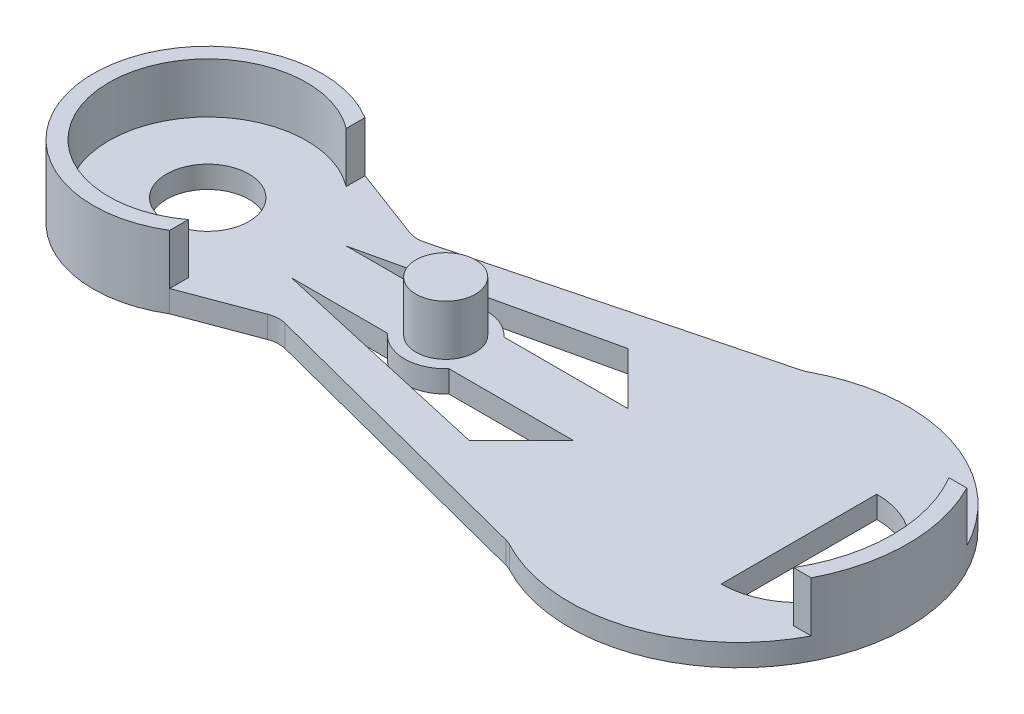
ISO-10303-21;
HEADER;
FILE_DESCRIPTION(('STEP AP214'),'2;1');
FILE_NAME('part.step','',(''),(''),'','','');
FILE_SCHEMA(('AUTOMOTIVE_DESIGN { 1 0 10303 214 1 1 1 1 }'));
ENDSEC;
DATA;
#1=APPLICATION_CONTEXT('core data for automotive mechanical design processes');
#2=APPLICATION_PROTOCOL_DEFINITION('international standard','automotive_design',2000,#1);
#3=PRODUCT_CONTEXT('',#1,'mechanical');
#4=PRODUCT('Part','Part','',(#3));
#5=PRODUCT_RELATED_PRODUCT_CATEGORY('part','',(#4));
#6=PRODUCT_DEFINITION_FORMATION('','',#4);
#7=PRODUCT_DEFINITION_CONTEXT('part definition',#1,'design');
#8=PRODUCT_DEFINITION('design','',#6,#7);
#9=PRODUCT_DEFINITION_SHAPE('','',#8);
#10=(LENGTH_UNIT() NAMED_UNIT(*) SI_UNIT(.MILLI.,.METRE.));
#11=(NAMED_UNIT(*) PLANE_ANGLE_UNIT() SI_UNIT($,.RADIAN.));
#12=(NAMED_UNIT(*) SI_UNIT($,.STERADIAN.) SOLID_ANGLE_UNIT());
#13=UNCERTAINTY_MEASURE_WITH_UNIT(LENGTH_MEASURE(1.E-05),#10,'distance_accuracy_value','');
#14=(GEOMETRIC_REPRESENTATION_CONTEXT(3) GLOBAL_UNCERTAINTY_ASSIGNED_CONTEXT((#13)) GLOBAL_UNIT_ASSIGNED_CONTEXT((#10,
#11,#12)) REPRESENTATION_CONTEXT('',''));
#15=CARTESIAN_POINT('',(0.,0.,0.));
#16=DIRECTION('',(0.,0.,1.));
#17=DIRECTION('',(1.,0.,0.));
#18=AXIS2_PLACEMENT_3D('',#15,#16,#17);
#19=CARTESIAN_POINT('',(-54.8824172838894,2.4,0.));
#20=DIRECTION('',(0.,-1.,0.));
#21=DIRECTION('',(0.,0.,-1.));
#22=AXIS2_PLACEMENT_3D('',#19,#20,#21);
#23=CYLINDRICAL_SURFACE('',#22,12.5);
#24=CARTESIAN_POINT('',(-54.8824172838894,0.,0.));
#25=DIRECTION('',(0.,1.,0.));
#26=DIRECTION('',(0.,0.,1.));
#27=AXIS2_PLACEMENT_3D('',#24,#25,#26);
#28=CIRCLE('',#27,12.5);
#29=CARTESIAN_POINT('',(-48.3711591182894,0.,-10.6702163567993));
#30=VERTEX_POINT('',#29);
#31=CARTESIAN_POINT('',(-48.3711591182894,0.,10.6702163567993));
#32=VERTEX_POINT('',#31);
#33=EDGE_CURVE('E441',#30,#32,#28,.T.);
#34=ORIENTED_EDGE('',*,*,#33,.T.);
#35=DIRECTION('',(0.,-1.,0.));
#36=VECTOR('',#35,1.);
#37=CARTESIAN_POINT('',(-48.3711591182894,2.4,10.6702163567993));
#38=LINE('',#37,#36);
#39=CARTESIAN_POINT('',(-48.3711591182894,2.4,10.6702163567993));
#40=VERTEX_POINT('',#39);
#41=EDGE_CURVE('E467',#40,#32,#38,.T.);
#42=ORIENTED_EDGE('',*,*,#41,.F.);
#43=DIRECTION('',(0.,-1.,0.));
#44=VECTOR('',#43,1.);
#45=CARTESIAN_POINT('',(-48.3711591182894,7.9,10.6702163567993));
#46=LINE('',#45,#44);
#47=CARTESIAN_POINT('',(-48.3711591182894,7.9,10.6702163567993));
#48=VERTEX_POINT('',#47);
#49=EDGE_CURVE('E304',#48,#40,#46,.T.);
#50=ORIENTED_EDGE('',*,*,#49,.F.);
#51=CARTESIAN_POINT('',(-54.8824172838894,7.9,0.));
#52=DIRECTION('',(0.,1.,0.));
#53=DIRECTION('',(0.,0.,1.));
#54=AXIS2_PLACEMENT_3D('',#51,#52,#53);
#55=CIRCLE('',#54,12.5);
#56=CARTESIAN_POINT('',(-48.3711591182894,7.9,-10.6702163567993));
#57=VERTEX_POINT('',#56);
#58=EDGE_CURVE('E291',#57,#48,#55,.T.);
#59=ORIENTED_EDGE('',*,*,#58,.F.);
#60=DIRECTION('',(0.,-1.,0.));
#61=VECTOR('',#60,1.);
#62=CARTESIAN_POINT('',(-48.3711591182894,7.9,-10.6702163567993));
#63=LINE('',#62,#61);
#64=CARTESIAN_POINT('',(-48.3711591182894,2.4,-10.6702163567993));
#65=VERTEX_POINT('',#64);
#66=EDGE_CURVE('E308',#57,#65,#63,.T.);
#67=ORIENTED_EDGE('',*,*,#66,.T.);
#68=DIRECTION('',(0.,-1.,0.));
#69=VECTOR('',#68,1.);
#70=CARTESIAN_POINT('',(-48.3711591182894,2.4,-10.6702163567993));
#71=LINE('',#70,#69);
#72=EDGE_CURVE('E464',#65,#30,#71,.T.);
#73=ORIENTED_EDGE('',*,*,#72,.T.);
#74=EDGE_LOOP('',(#34,#42,#50,#59,#67,#73));
#75=FACE_BOUND('',#74,.T.);
#76=ADVANCED_FACE('F45',(#75),#23,.T.);
#77=CARTESIAN_POINT('',(-2.45707890344702,2.4,-6.55092972925865));
#78=DIRECTION('',(-0.351183619747819,0.,-0.936306608553426));
#79=DIRECTION('',(-0.936306608553427,0.,0.351183619747819));
#80=AXIS2_PLACEMENT_3D('',#77,#78,#79);
#81=PLANE('',#80);
#82=DIRECTION('',(0.936306608553427,0.,-0.351183619747819));
#83=VECTOR('',#82,1.);
#84=CARTESIAN_POINT('',(-2.45707890344702,0.,-6.55092972925865));
#85=LINE('',#84,#83);
#86=CARTESIAN_POINT('',(-40.5871949467527,0.,7.75065914255413));
#87=VERTEX_POINT('',#86);
#88=EDGE_CURVE('E445',#32,#87,#85,.T.);
#89=ORIENTED_EDGE('',*,*,#88,.T.);
#90=DIRECTION('',(0.,-1.,0.));
#91=VECTOR('',#90,1.);
#92=CARTESIAN_POINT('',(-40.5871949467527,2.4,7.75065914255414));
#93=LINE('',#92,#91);
#94=CARTESIAN_POINT('',(-40.5871949467527,2.4,7.75065914255413));
#95=VERTEX_POINT('',#94);
#96=EDGE_CURVE('E537',#87,#95,#93,.F.);
#97=ORIENTED_EDGE('',*,*,#96,.T.);
#98=DIRECTION('',(0.936306608553427,0.,-0.351183619747819));
#99=VECTOR('',#98,1.);
#100=CARTESIAN_POINT('',(-2.45707890344702,2.4,-6.55092972925865));
#101=LINE('',#100,#99);
#102=EDGE_CURVE('E373',#40,#95,#101,.T.);
#103=ORIENTED_EDGE('',*,*,#102,.F.);
#104=ORIENTED_EDGE('',*,*,#41,.T.);
#105=EDGE_LOOP('',(#89,#97,#103,#104));
#106=FACE_BOUND('',#105,.T.);
#107=ADVANCED_FACE('F566',(#106),#81,.F.);
#108=CARTESIAN_POINT('',(-4.29192281992173,2.4,16.5822216350549));
#109=DIRECTION('',(0.250569813551526,0.,-0.968098532452536));
#110=DIRECTION('',(-0.968098532452536,0.,-0.250569813551526));
#111=AXIS2_PLACEMENT_3D('',#108,#109,#110);
#112=PLANE('',#111);
#113=DIRECTION('',(0.968098532452536,0.,0.250569813551526));
#114=VECTOR('',#113,1.);
#115=CARTESIAN_POINT('',(-4.29192281992173,0.,16.5822216350549));
#116=LINE('',#115,#114);
#117=CARTESIAN_POINT('',(-38.7819346468547,0.,7.6552833708568));
#118=VERTEX_POINT('',#117);
#119=CARTESIAN_POINT('',(-6.21340742603769,0.,16.0848899860987));
#120=VERTEX_POINT('',#119);
#121=EDGE_CURVE('E449',#118,#120,#116,.T.);
#122=ORIENTED_EDGE('',*,*,#121,.T.);
#123=DIRECTION('',(0.,1.,0.));
#124=VECTOR('',#123,1.);
#125=CARTESIAN_POINT('',(-6.21340742603769,2.4,16.0848899860987));
#126=LINE('',#125,#124);
#127=CARTESIAN_POINT('',(-6.21340742603769,2.4,16.0848899860987));
#128=VERTEX_POINT('',#127);
#129=EDGE_CURVE('E530',#120,#128,#126,.T.);
#130=ORIENTED_EDGE('',*,*,#129,.T.);
#131=DIRECTION('',(0.968098532452536,0.,0.250569813551526));
#132=VECTOR('',#131,1.);
#133=CARTESIAN_POINT('',(-4.29192281992173,2.4,16.5822216350549));
#134=LINE('',#133,#132);
#135=CARTESIAN_POINT('',(-38.7819346468547,2.4,7.6552833708568));
#136=VERTEX_POINT('',#135);
#137=EDGE_CURVE('E377',#136,#128,#134,.T.);
#138=ORIENTED_EDGE('',*,*,#137,.F.);
#139=DIRECTION('',(0.,-1.,0.));
#140=VECTOR('',#139,1.);
#141=CARTESIAN_POINT('',(-38.7819346468547,0.,7.6552833708568));
#142=LINE('',#141,#140);
#143=EDGE_CURVE('E526',#136,#118,#142,.T.);
#144=ORIENTED_EDGE('',*,*,#143,.T.);
#145=EDGE_LOOP('',(#122,#130,#138,#144));
#146=FACE_BOUND('',#145,.T.);
#147=ADVANCED_FACE('F575',(#146),#112,.F.);
#148=CARTESIAN_POINT('',(3.11758271611062,2.4,0.));
#149=DIRECTION('',(0.,-1.,0.));
#150=DIRECTION('',(0.,0.,-1.));
#151=AXIS2_PLACEMENT_3D('',#148,#149,#150);
#152=CYLINDRICAL_SURFACE('',#151,18.5);
#153=CARTESIAN_POINT('',(3.11758271611062,0.,0.));
#154=DIRECTION('',(0.,1.,0.));
#155=DIRECTION('',(0.,0.,1.));
#156=AXIS2_PLACEMENT_3D('',#153,#154,#155);
#157=CIRCLE('',#156,18.5);
#158=CARTESIAN_POINT('',(-5.55822855281279,0.,16.3395317811136));
#159=VERTEX_POINT('',#158);
#160=CARTESIAN_POINT('',(-5.55822855281279,0.,-16.3395317811136));
#161=VERTEX_POINT('',#160);
#162=EDGE_CURVE('E453',#159,#161,#157,.T.);
#163=ORIENTED_EDGE('',*,*,#162,.T.);
#164=DIRECTION('',(0.,-1.,0.));
#165=VECTOR('',#164,1.);
#166=CARTESIAN_POINT('',(-5.55822855281279,2.4,-16.3395317811136));
#167=LINE('',#166,#165);
#168=CARTESIAN_POINT('',(-5.55822855281279,2.4,-16.3395317811136));
#169=VERTEX_POINT('',#168);
#170=EDGE_CURVE('E522',#161,#169,#167,.F.);
#171=ORIENTED_EDGE('',*,*,#170,.T.);
#172=CARTESIAN_POINT('',(3.11758271611062,2.4,0.));
#173=DIRECTION('',(0.,1.,0.));
#174=DIRECTION('',(0.,0.,1.));
#175=AXIS2_PLACEMENT_3D('',#172,#173,#174);
#176=CIRCLE('',#175,18.5);
#177=CARTESIAN_POINT('',(19.5492594412656,2.4,-8.5));
#178=VERTEX_POINT('',#177);
#179=EDGE_CURVE('E381',#178,#169,#176,.T.);
#180=ORIENTED_EDGE('',*,*,#179,.F.);
#181=DIRECTION('',(0.,-1.,0.));
#182=VECTOR('',#181,1.);
#183=CARTESIAN_POINT('',(19.5492594412656,7.9,-8.5));
#184=LINE('',#183,#182);
#185=CARTESIAN_POINT('',(19.5492594412656,7.9,-8.5));
#186=VERTEX_POINT('',#185);
#187=EDGE_CURVE('E269',#186,#178,#184,.T.);
#188=ORIENTED_EDGE('',*,*,#187,.F.);
#189=CARTESIAN_POINT('',(3.11758271611062,7.9,0.));
#190=DIRECTION('',(0.,1.,0.));
#191=DIRECTION('',(0.,0.,1.));
#192=AXIS2_PLACEMENT_3D('',#189,#190,#191);
#193=CIRCLE('',#192,18.5);
#194=CARTESIAN_POINT('',(19.5492594412656,7.9,8.5));
#195=VERTEX_POINT('',#194);
#196=EDGE_CURVE('E258',#195,#186,#193,.T.);
#197=ORIENTED_EDGE('',*,*,#196,.F.);
#198=DIRECTION('',(0.,-1.,0.));
#199=VECTOR('',#198,1.);
#200=CARTESIAN_POINT('',(19.5492594412656,7.9,8.5));
#201=LINE('',#200,#199);
#202=CARTESIAN_POINT('',(19.5492594412656,2.4,8.5));
#203=VERTEX_POINT('',#202);
#204=EDGE_CURVE('E276',#195,#203,#201,.T.);
#205=ORIENTED_EDGE('',*,*,#204,.T.);
#206=CARTESIAN_POINT('',(-5.55822855281279,2.4,16.3395317811136));
#207=VERTEX_POINT('',#206);
#208=EDGE_CURVE('E382',#207,#203,#176,.T.);
#209=ORIENTED_EDGE('',*,*,#208,.F.);
#210=DIRECTION('',(0.,-1.,0.));
#211=VECTOR('',#210,1.);
#212=CARTESIAN_POINT('',(-5.55822855281279,2.4,16.3395317811136));
#213=LINE('',#212,#211);
#214=EDGE_CURVE('E518',#207,#159,#213,.T.);
#215=ORIENTED_EDGE('',*,*,#214,.T.);
#216=EDGE_LOOP('',(#163,#171,#180,#188,#197,#205,#209,#215));
#217=FACE_BOUND('',#216,.T.);
#218=ADVANCED_FACE('F582',(#217),#152,.T.);
#219=CARTESIAN_POINT('',(-4.29192281992173,2.4,-16.5822216350549));
#220=DIRECTION('',(-0.250569813551526,0.,-0.968098532452536));
#221=DIRECTION('',(-0.968098532452536,0.,0.250569813551526));
#222=AXIS2_PLACEMENT_3D('',#219,#220,#221);
#223=PLANE('',#222);
#224=DIRECTION('',(0.968098532452536,0.,-0.250569813551526));
#225=VECTOR('',#224,1.);
#226=CARTESIAN_POINT('',(-4.29192281992173,2.4,-16.5822216350549));
#227=LINE('',#226,#225);
#228=CARTESIAN_POINT('',(-38.7819346468547,2.4,-7.6552833708568));
#229=VERTEX_POINT('',#228);
#230=CARTESIAN_POINT('',(-6.21340742603769,2.4,-16.0848899860987));
#231=VERTEX_POINT('',#230);
#232=EDGE_CURVE('E385',#229,#231,#227,.T.);
#233=ORIENTED_EDGE('',*,*,#232,.T.);
#234=DIRECTION('',(0.,-1.,0.));
#235=VECTOR('',#234,1.);
#236=CARTESIAN_POINT('',(-6.21340742603769,2.4,-16.0848899860987));
#237=LINE('',#236,#235);
#238=CARTESIAN_POINT('',(-6.21340742603769,0.,-16.0848899860987));
#239=VERTEX_POINT('',#238);
#240=EDGE_CURVE('E514',#231,#239,#237,.T.);
#241=ORIENTED_EDGE('',*,*,#240,.T.);
#242=DIRECTION('',(0.968098532452536,0.,-0.250569813551526));
#243=VECTOR('',#242,1.);
#244=CARTESIAN_POINT('',(-4.29192281992173,0.,-16.5822216350549));
#245=LINE('',#244,#243);
#246=CARTESIAN_POINT('',(-38.7819346468547,0.,-7.6552833708568));
#247=VERTEX_POINT('',#246);
#248=EDGE_CURVE('E457',#247,#239,#245,.T.);
#249=ORIENTED_EDGE('',*,*,#248,.F.);
#250=DIRECTION('',(0.,-1.,0.));
#251=VECTOR('',#250,1.);
#252=CARTESIAN_POINT('',(-38.7819346468547,2.4,-7.6552833708568));
#253=LINE('',#252,#251);
#254=EDGE_CURVE('E472',#247,#229,#253,.F.);
#255=ORIENTED_EDGE('',*,*,#254,.T.);
#256=EDGE_LOOP('',(#233,#241,#249,#255));
#257=FACE_BOUND('',#256,.T.);
#258=ADVANCED_FACE('F618',(#257),#223,.T.);
#259=CARTESIAN_POINT('',(9.717339795003,2.4,0.));
#260=DIRECTION('',(1.,0.,0.));
#261=DIRECTION('',(0.,0.,-1.));
#262=AXIS2_PLACEMENT_3D('',#259,#260,#261);
#263=PLANE('',#262);
#264=DIRECTION('',(0.,0.,1.));
#265=VECTOR('',#264,1.);
#266=CARTESIAN_POINT('',(9.717339795003,0.,0.));
#267=LINE('',#266,#265);
#268=CARTESIAN_POINT('',(9.717339795003,0.,-8.5));
#269=VERTEX_POINT('',#268);
#270=CARTESIAN_POINT('',(9.717339795003,0.,8.5));
#271=VERTEX_POINT('',#270);
#272=EDGE_CURVE('E429',#269,#271,#267,.T.);
#273=ORIENTED_EDGE('',*,*,#272,.F.);
#274=DIRECTION('',(0.,-1.,0.));
#275=VECTOR('',#274,1.);
#276=CARTESIAN_POINT('',(9.717339795003,2.4,-8.5));
#277=LINE('',#276,#275);
#278=CARTESIAN_POINT('',(9.717339795003,2.4,-8.5));
#279=VERTEX_POINT('',#278);
#280=EDGE_CURVE('E468',#279,#269,#277,.T.);
#281=ORIENTED_EDGE('',*,*,#280,.F.);
#282=DIRECTION('',(0.,0.,1.));
#283=VECTOR('',#282,1.);
#284=CARTESIAN_POINT('',(9.717339795003,2.4,0.));
#285=LINE('',#284,#283);
#286=CARTESIAN_POINT('',(9.717339795003,2.4,8.5));
#287=VERTEX_POINT('',#286);
#288=EDGE_CURVE('E361',#279,#287,#285,.T.);
#289=ORIENTED_EDGE('',*,*,#288,.T.);
#290=DIRECTION('',(0.,-1.,0.));
#291=VECTOR('',#290,1.);
#292=CARTESIAN_POINT('',(9.717339795003,2.4,8.5));
#293=LINE('',#292,#291);
#294=EDGE_CURVE('E473',#287,#271,#293,.T.);
#295=ORIENTED_EDGE('',*,*,#294,.T.);
#296=EDGE_LOOP('',(#273,#281,#289,#295));
#297=FACE_BOUND('',#296,.T.);
#298=ADVANCED_FACE('F614',(#297),#263,.T.);
#299=CARTESIAN_POINT('',(-4.47527295076371,2.4,4.47527295076364));
#300=DIRECTION('',(-0.707106781186554,0.,0.707106781186541));
#301=DIRECTION('',(0.707106781186541,0.,0.707106781186554));
#302=AXIS2_PLACEMENT_3D('',#299,#300,#301);
#303=PLANE('',#302);
#304=DIRECTION('',(-0.707106781186541,0.,-0.707106781186554));
#305=VECTOR('',#304,1.);
#306=CARTESIAN_POINT('',(-4.47527295076371,0.,4.47527295076364));
#307=LINE('',#306,#305);
#308=CARTESIAN_POINT('',(-11.9505459015272,0.,-3.00000000000001));
#309=VERTEX_POINT('',#308);
#310=CARTESIAN_POINT('',(-17.6349450814917,0.,-8.68439917996457));
#311=VERTEX_POINT('',#310);
#312=EDGE_CURVE('E409',#309,#311,#307,.T.);
#313=ORIENTED_EDGE('',*,*,#312,.F.);
#314=DIRECTION('',(0.,-1.,0.));
#315=VECTOR('',#314,1.);
#316=CARTESIAN_POINT('',(-11.9505459015272,2.4,-3.00000000000001));
#317=LINE('',#316,#315);
#318=CARTESIAN_POINT('',(-11.9505459015272,2.4,-3.00000000000001));
#319=VERTEX_POINT('',#318);
#320=EDGE_CURVE('E476',#319,#309,#317,.T.);
#321=ORIENTED_EDGE('',*,*,#320,.F.);
#322=DIRECTION('',(-0.707106781186541,0.,-0.707106781186554));
#323=VECTOR('',#322,1.);
#324=CARTESIAN_POINT('',(-4.47527295076371,2.4,4.47527295076364));
#325=LINE('',#324,#323);
#326=CARTESIAN_POINT('',(-17.6349450814917,2.4,-8.68439917996457));
#327=VERTEX_POINT('',#326);
#328=EDGE_CURVE('E342',#319,#327,#325,.T.);
#329=ORIENTED_EDGE('',*,*,#328,.T.);
#330=DIRECTION('',(0.,-1.,0.));
#331=VECTOR('',#330,1.);
#332=CARTESIAN_POINT('',(-17.6349450814917,2.4,-8.68439917996457));
#333=LINE('',#332,#331);
#334=EDGE_CURVE('E479',#327,#311,#333,.T.);
#335=ORIENTED_EDGE('',*,*,#334,.T.);
#336=EDGE_LOOP('',(#313,#321,#329,#335));
#337=FACE_BOUND('',#336,.T.);
#338=ADVANCED_FACE('F617',(#337),#303,.T.);
#339=CARTESIAN_POINT('',(0.,2.4,-3.));
#340=DIRECTION('',(0.,0.,-1.));
#341=DIRECTION('',(-1.,0.,0.));
#342=AXIS2_PLACEMENT_3D('',#339,#340,#341);
#343=PLANE('',#342);
#344=DIRECTION('',(1.,0.,0.));
#345=VECTOR('',#344,1.);
#346=CARTESIAN_POINT('',(0.,0.,-3.));
#347=LINE('',#346,#345);
#348=CARTESIAN_POINT('',(-25.5283153176397,0.,-3.00000000000001));
#349=VERTEX_POINT('',#348);
#350=EDGE_CURVE('E413',#349,#309,#347,.T.);
#351=ORIENTED_EDGE('',*,*,#350,.F.);
#352=DIRECTION('',(0.,-1.,0.));
#353=VECTOR('',#352,1.);
#354=CARTESIAN_POINT('',(-25.5283153176397,2.4,-3.00000000000001));
#355=LINE('',#354,#353);
#356=CARTESIAN_POINT('',(-25.5283153176397,2.4,-3.00000000000001));
#357=VERTEX_POINT('',#356);
#358=EDGE_CURVE('E489',#357,#349,#355,.T.);
#359=ORIENTED_EDGE('',*,*,#358,.F.);
#360=DIRECTION('',(1.,0.,0.));
#361=VECTOR('',#360,1.);
#362=CARTESIAN_POINT('',(0.,2.4,-3.));
#363=LINE('',#362,#361);
#364=EDGE_CURVE('E346',#357,#319,#363,.T.);
#365=ORIENTED_EDGE('',*,*,#364,.T.);
#366=ORIENTED_EDGE('',*,*,#320,.T.);
#367=EDGE_LOOP('',(#351,#359,#365,#366));
#368=FACE_BOUND('',#367,.T.);
#369=ADVANCED_FACE('F632',(#368),#343,.T.);
#370=CARTESIAN_POINT('',(-28.8824172838894,2.4,0.));
#371=DIRECTION('',(0.,-1.,0.));
#372=DIRECTION('',(0.,0.,-1.));
#373=AXIS2_PLACEMENT_3D('',#370,#371,#372);
#374=CYLINDRICAL_SURFACE('',#373,4.5);
#375=CARTESIAN_POINT('',(-28.8824172838894,0.,0.));
#376=DIRECTION('',(0.,1.,0.));
#377=DIRECTION('',(0.,0.,1.));
#378=AXIS2_PLACEMENT_3D('',#375,#376,#377);
#379=CIRCLE('',#378,4.5);
#380=CARTESIAN_POINT('',(-32.2365192501391,0.,-3.00000000000001));
#381=VERTEX_POINT('',#380);
#382=EDGE_CURVE('E417',#349,#381,#379,.T.);
#383=ORIENTED_EDGE('',*,*,#382,.T.);
#384=DIRECTION('',(0.,-1.,0.));
#385=VECTOR('',#384,1.);
#386=CARTESIAN_POINT('',(-32.2365192501391,2.4,-3.00000000000001));
#387=LINE('',#386,#385);
#388=CARTESIAN_POINT('',(-32.2365192501391,2.4,-3.00000000000001));
#389=VERTEX_POINT('',#388);
#390=EDGE_CURVE('E486',#389,#381,#387,.T.);
#391=ORIENTED_EDGE('',*,*,#390,.F.);
#392=CARTESIAN_POINT('',(-28.8824172838894,2.4,0.));
#393=DIRECTION('',(0.,1.,0.));
#394=DIRECTION('',(0.,0.,1.));
#395=AXIS2_PLACEMENT_3D('',#392,#393,#394);
#396=CIRCLE('',#395,4.5);
#397=EDGE_CURVE('E350',#357,#389,#396,.T.);
#398=ORIENTED_EDGE('',*,*,#397,.F.);
#399=ORIENTED_EDGE('',*,*,#358,.T.);
#400=EDGE_LOOP('',(#383,#391,#398,#399));
#401=FACE_BOUND('',#400,.T.);
#402=ADVANCED_FACE('F628',(#401),#374,.T.);
#403=CARTESIAN_POINT('',(0.,2.4,-3.00000000000001));
#404=DIRECTION('',(0.,0.,-1.));
#405=DIRECTION('',(-1.,0.,0.));
#406=AXIS2_PLACEMENT_3D('',#403,#404,#405);
#407=PLANE('',#406);
#408=DIRECTION('',(1.,0.,0.));
#409=VECTOR('',#408,1.);
#410=CARTESIAN_POINT('',(0.,0.,-3.00000000000001));
#411=LINE('',#410,#409);
#412=CARTESIAN_POINT('',(-42.7477561843778,0.,-3.));
#413=VERTEX_POINT('',#412);
#414=EDGE_CURVE('E421',#413,#381,#411,.T.);
#415=ORIENTED_EDGE('',*,*,#414,.F.);
#416=DIRECTION('',(0.,-1.,0.));
#417=VECTOR('',#416,1.);
#418=CARTESIAN_POINT('',(-42.7477561843778,2.4,-3.));
#419=LINE('',#418,#417);
#420=CARTESIAN_POINT('',(-42.7477561843778,2.4,-3.));
#421=VERTEX_POINT('',#420);
#422=EDGE_CURVE('E482',#421,#413,#419,.T.);
#423=ORIENTED_EDGE('',*,*,#422,.F.);
#424=DIRECTION('',(1.,0.,0.));
#425=VECTOR('',#424,1.);
#426=CARTESIAN_POINT('',(0.,2.4,-3.00000000000001));
#427=LINE('',#426,#425);
#428=EDGE_CURVE('E353',#421,#389,#427,.T.);
#429=ORIENTED_EDGE('',*,*,#428,.T.);
#430=ORIENTED_EDGE('',*,*,#390,.T.);
#431=EDGE_LOOP('',(#415,#423,#429,#430));
#432=FACE_BOUND('',#431,.T.);
#433=ADVANCED_FACE('F624',(#432),#407,.T.);
#434=CARTESIAN_POINT('',(0.,2.4,3.));
#435=DIRECTION('',(0.,0.,-1.));
#436=DIRECTION('',(-1.,0.,0.));
#437=AXIS2_PLACEMENT_3D('',#434,#435,#436);
#438=PLANE('',#437);
#439=DIRECTION('',(1.,0.,0.));
#440=VECTOR('',#439,1.);
#441=CARTESIAN_POINT('',(0.,0.,3.));
#442=LINE('',#441,#440);
#443=CARTESIAN_POINT('',(-25.5283153176397,0.,3.00000000000001));
#444=VERTEX_POINT('',#443);
#445=CARTESIAN_POINT('',(-11.9505459015272,0.,3.00000000000001));
#446=VERTEX_POINT('',#445);
#447=EDGE_CURVE('E321',#444,#446,#442,.T.);
#448=ORIENTED_EDGE('',*,*,#447,.T.);
#449=DIRECTION('',(0.,-1.,0.));
#450=VECTOR('',#449,1.);
#451=CARTESIAN_POINT('',(-11.9505459015272,2.4,3.00000000000001));
#452=LINE('',#451,#450);
#453=CARTESIAN_POINT('',(-11.9505459015272,2.4,3.00000000000001));
#454=VERTEX_POINT('',#453);
#455=EDGE_CURVE('E483',#454,#446,#452,.T.);
#456=ORIENTED_EDGE('',*,*,#455,.F.);
#457=DIRECTION('',(1.,0.,0.));
#458=VECTOR('',#457,1.);
#459=CARTESIAN_POINT('',(0.,2.4,3.));
#460=LINE('',#459,#458);
#461=CARTESIAN_POINT('',(-25.5283153176397,2.4,3.00000000000001));
#462=VERTEX_POINT('',#461);
#463=EDGE_CURVE('E325',#462,#454,#460,.T.);
#464=ORIENTED_EDGE('',*,*,#463,.F.);
#465=DIRECTION('',(0.,-1.,0.));
#466=VECTOR('',#465,1.);
#467=CARTESIAN_POINT('',(-25.5283153176397,2.4,3.00000000000001));
#468=LINE('',#467,#466);
#469=EDGE_CURVE('E393',#462,#444,#468,.T.);
#470=ORIENTED_EDGE('',*,*,#469,.T.);
#471=EDGE_LOOP('',(#448,#456,#464,#470));
#472=FACE_BOUND('',#471,.T.);
#473=ADVANCED_FACE('F627',(#472),#438,.F.);
#474=CARTESIAN_POINT('',(-4.47527295076374,2.4,-4.47527295076364));
#475=DIRECTION('',(0.707106781186555,0.,0.70710678118654));
#476=DIRECTION('',(0.70710678118654,0.,-0.707106781186555));
#477=AXIS2_PLACEMENT_3D('',#474,#475,#476);
#478=PLANE('',#477);
#479=DIRECTION('',(-0.70710678118654,0.,0.707106781186555));
#480=VECTOR('',#479,1.);
#481=CARTESIAN_POINT('',(-4.47527295076374,0.,-4.47527295076364));
#482=LINE('',#481,#480);
#483=CARTESIAN_POINT('',(-17.6349450814917,0.,8.68439917996458));
#484=VERTEX_POINT('',#483);
#485=EDGE_CURVE('E397',#446,#484,#482,.T.);
#486=ORIENTED_EDGE('',*,*,#485,.T.);
#487=DIRECTION('',(0.,-1.,0.));
#488=VECTOR('',#487,1.);
#489=CARTESIAN_POINT('',(-17.6349450814917,2.4,8.68439917996458));
#490=LINE('',#489,#488);
#491=CARTESIAN_POINT('',(-17.6349450814917,2.4,8.68439917996458));
#492=VERTEX_POINT('',#491);
#493=EDGE_CURVE('E505',#492,#484,#490,.T.);
#494=ORIENTED_EDGE('',*,*,#493,.F.);
#495=DIRECTION('',(-0.70710678118654,0.,0.707106781186555));
#496=VECTOR('',#495,1.);
#497=CARTESIAN_POINT('',(-4.47527295076374,2.4,-4.47527295076364));
#498=LINE('',#497,#496);
#499=EDGE_CURVE('E329',#454,#492,#498,.T.);
#500=ORIENTED_EDGE('',*,*,#499,.F.);
#501=ORIENTED_EDGE('',*,*,#455,.T.);
#502=EDGE_LOOP('',(#486,#494,#500,#501));
#503=FACE_BOUND('',#502,.T.);
#504=ADVANCED_FACE('F650',(#503),#478,.F.);
#505=CARTESIAN_POINT('',(-2.7294566481405,2.4,12.0583243801496));
#506=DIRECTION('',(-0.22076948586132,0.,0.975326014270371));
#507=DIRECTION('',(0.975326014270371,0.,0.22076948586132));
#508=AXIS2_PLACEMENT_3D('',#505,#506,#507);
#509=PLANE('',#508);
#510=DIRECTION('',(-0.975326014270371,0.,-0.22076948586132));
#511=VECTOR('',#510,1.);
#512=CARTESIAN_POINT('',(-2.7294566481405,0.,12.0583243801496));
#513=LINE('',#512,#511);
#514=CARTESIAN_POINT('',(-42.7477561843778,0.,3.));
#515=VERTEX_POINT('',#514);
#516=EDGE_CURVE('E400',#484,#515,#513,.T.);
#517=ORIENTED_EDGE('',*,*,#516,.T.);
#518=DIRECTION('',(0.,-1.,0.));
#519=VECTOR('',#518,1.);
#520=CARTESIAN_POINT('',(-42.7477561843778,2.4,3.));
#521=LINE('',#520,#519);
#522=CARTESIAN_POINT('',(-42.7477561843778,2.4,3.));
#523=VERTEX_POINT('',#522);
#524=EDGE_CURVE('E501',#523,#515,#521,.T.);
#525=ORIENTED_EDGE('',*,*,#524,.F.);
#526=DIRECTION('',(-0.975326014270371,0.,-0.22076948586132));
#527=VECTOR('',#526,1.);
#528=CARTESIAN_POINT('',(-2.7294566481405,2.4,12.0583243801496));
#529=LINE('',#528,#527);
#530=EDGE_CURVE('E333',#492,#523,#529,.T.);
#531=ORIENTED_EDGE('',*,*,#530,.F.);
#532=ORIENTED_EDGE('',*,*,#493,.T.);
#533=EDGE_LOOP('',(#517,#525,#531,#532));
#534=FACE_BOUND('',#533,.T.);
#535=ADVANCED_FACE('F646',(#534),#509,.F.);
#536=CARTESIAN_POINT('',(0.,2.4,3.00000000000001));
#537=DIRECTION('',(0.,0.,-1.));
#538=DIRECTION('',(-1.,0.,0.));
#539=AXIS2_PLACEMENT_3D('',#536,#537,#538);
#540=PLANE('',#539);
#541=DIRECTION('',(1.,0.,0.));
#542=VECTOR('',#541,1.);
#543=CARTESIAN_POINT('',(0.,0.,3.00000000000001));
#544=LINE('',#543,#542);
#545=CARTESIAN_POINT('',(-32.2365192501391,0.,3.00000000000001));
#546=VERTEX_POINT('',#545);
#547=EDGE_CURVE('E403',#515,#546,#544,.T.);
#548=ORIENTED_EDGE('',*,*,#547,.T.);
#549=DIRECTION('',(0.,-1.,0.));
#550=VECTOR('',#549,1.);
#551=CARTESIAN_POINT('',(-32.2365192501391,2.4,3.00000000000001));
#552=LINE('',#551,#550);
#553=CARTESIAN_POINT('',(-32.2365192501391,2.4,3.00000000000001));
#554=VERTEX_POINT('',#553);
#555=EDGE_CURVE('E497',#554,#546,#552,.T.);
#556=ORIENTED_EDGE('',*,*,#555,.F.);
#557=DIRECTION('',(1.,0.,0.));
#558=VECTOR('',#557,1.);
#559=CARTESIAN_POINT('',(0.,2.4,3.00000000000001));
#560=LINE('',#559,#558);
#561=EDGE_CURVE('E336',#523,#554,#560,.T.);
#562=ORIENTED_EDGE('',*,*,#561,.F.);
#563=ORIENTED_EDGE('',*,*,#524,.T.);
#564=EDGE_LOOP('',(#548,#556,#562,#563));
#565=FACE_BOUND('',#564,.T.);
#566=ADVANCED_FACE('F608',(#565),#540,.F.);
#567=CARTESIAN_POINT('',(-54.8824172838894,2.4,0.));
#568=DIRECTION('',(0.,-1.,0.));
#569=DIRECTION('',(0.,0.,-1.));
#570=AXIS2_PLACEMENT_3D('',#567,#568,#569);
#571=CYLINDRICAL_SURFACE('',#570,4.5);
#572=CARTESIAN_POINT('',(-54.8824172838894,2.4,0.));
#573=DIRECTION('',(0.,1.,0.));
#574=DIRECTION('',(0.,0.,1.));
#575=AXIS2_PLACEMENT_3D('',#572,#573,#574);
#576=CIRCLE('',#575,4.5);
#577=CARTESIAN_POINT('',(-54.8824172838894,2.4,4.5));
#578=VERTEX_POINT('',#577);
#579=EDGE_CURVE('E369',#578,#578,#576,.T.);
#580=ORIENTED_EDGE('',*,*,#579,.T.);
#581=EDGE_LOOP('',(#580));
#582=FACE_BOUND('',#581,.T.);
#583=CARTESIAN_POINT('',(-54.8824172838894,0.,0.));
#584=DIRECTION('',(0.,1.,0.));
#585=DIRECTION('',(0.,0.,1.));
#586=AXIS2_PLACEMENT_3D('',#583,#584,#585);
#587=CIRCLE('',#586,4.5);
#588=CARTESIAN_POINT('',(-54.8824172838894,0.,4.5));
#589=VERTEX_POINT('',#588);
#590=EDGE_CURVE('E437',#589,#589,#587,.T.);
#591=ORIENTED_EDGE('',*,*,#590,.F.);
#592=EDGE_LOOP('',(#591));
#593=FACE_BOUND('',#592,.T.);
#594=ADVANCED_FACE('F604',(#582,#593),#571,.F.);
#595=CARTESIAN_POINT('',(9.717339795003,2.4,0.));
#596=DIRECTION('',(0.,-1.,0.));
#597=DIRECTION('',(0.,0.,-1.));
#598=AXIS2_PLACEMENT_3D('',#595,#596,#597);
#599=CYLINDRICAL_SURFACE('',#598,8.5);
#600=CARTESIAN_POINT('',(9.717339795003,0.,0.));
#601=DIRECTION('',(0.,1.,0.));
#602=DIRECTION('',(0.,0.,1.));
#603=AXIS2_PLACEMENT_3D('',#600,#601,#602);
#604=CIRCLE('',#603,8.5);
#605=EDGE_CURVE('E433',#271,#269,#604,.T.);
#606=ORIENTED_EDGE('',*,*,#605,.F.);
#607=ORIENTED_EDGE('',*,*,#294,.F.);
#608=CARTESIAN_POINT('',(9.717339795003,2.4,0.));
#609=DIRECTION('',(0.,1.,0.));
#610=DIRECTION('',(0.,0.,1.));
#611=AXIS2_PLACEMENT_3D('',#608,#609,#610);
#612=CIRCLE('',#611,8.5);
#613=EDGE_CURVE('E365',#287,#279,#612,.T.);
#614=ORIENTED_EDGE('',*,*,#613,.T.);
#615=ORIENTED_EDGE('',*,*,#280,.T.);
#616=EDGE_LOOP('',(#606,#607,#614,#615));
#617=FACE_BOUND('',#616,.T.);
#618=ADVANCED_FACE('F607',(#617),#599,.F.);
#619=CARTESIAN_POINT('',(-2.7294566481405,2.4,-12.0583243801496));
#620=DIRECTION('',(0.22076948586132,0.,0.975326014270371));
#621=DIRECTION('',(0.975326014270371,0.,-0.22076948586132));
#622=AXIS2_PLACEMENT_3D('',#619,#620,#621);
#623=PLANE('',#622);
#624=DIRECTION('',(-0.975326014270371,0.,0.22076948586132));
#625=VECTOR('',#624,1.);
#626=CARTESIAN_POINT('',(-2.7294566481405,0.,-12.0583243801496));
#627=LINE('',#626,#625);
#628=EDGE_CURVE('E425',#311,#413,#627,.T.);
#629=ORIENTED_EDGE('',*,*,#628,.F.);
#630=ORIENTED_EDGE('',*,*,#334,.F.);
#631=DIRECTION('',(-0.975326014270371,0.,0.22076948586132));
#632=VECTOR('',#631,1.);
#633=CARTESIAN_POINT('',(-2.7294566481405,2.4,-12.0583243801496));
#634=LINE('',#633,#632);
#635=EDGE_CURVE('E357',#327,#421,#634,.T.);
#636=ORIENTED_EDGE('',*,*,#635,.T.);
#637=ORIENTED_EDGE('',*,*,#422,.T.);
#638=EDGE_LOOP('',(#629,#630,#636,#637));
#639=FACE_BOUND('',#638,.T.);
#640=ADVANCED_FACE('F612',(#639),#623,.T.);
#641=CARTESIAN_POINT('',(-28.8824172838894,2.4,0.));
#642=DIRECTION('',(0.,-1.,0.));
#643=DIRECTION('',(0.,0.,-1.));
#644=AXIS2_PLACEMENT_3D('',#641,#642,#643);
#645=CYLINDRICAL_SURFACE('',#644,4.5);
#646=CARTESIAN_POINT('',(-28.8824172838894,0.,0.));
#647=DIRECTION('',(0.,1.,0.));
#648=DIRECTION('',(0.,0.,1.));
#649=AXIS2_PLACEMENT_3D('',#646,#647,#648);
#650=CIRCLE('',#649,4.5);
#651=EDGE_CURVE('E406',#546,#444,#650,.T.);
#652=ORIENTED_EDGE('',*,*,#651,.T.);
#653=ORIENTED_EDGE('',*,*,#469,.F.);
#654=CARTESIAN_POINT('',(-28.8824172838894,2.4,0.));
#655=DIRECTION('',(0.,1.,0.));
#656=DIRECTION('',(0.,0.,1.));
#657=AXIS2_PLACEMENT_3D('',#654,#655,#656);
#658=CIRCLE('',#657,4.5);
#659=EDGE_CURVE('E339',#554,#462,#658,.T.);
#660=ORIENTED_EDGE('',*,*,#659,.F.);
#661=ORIENTED_EDGE('',*,*,#555,.T.);
#662=EDGE_LOOP('',(#652,#653,#660,#661));
#663=FACE_BOUND('',#662,.T.);
#664=ADVANCED_FACE('F622',(#663),#645,.T.);
#665=CARTESIAN_POINT('',(-2.45707890344702,2.4,6.55092972925865));
#666=DIRECTION('',(0.351183619747819,0.,-0.936306608553426));
#667=DIRECTION('',(-0.936306608553427,0.,-0.351183619747819));
#668=AXIS2_PLACEMENT_3D('',#665,#666,#667);
#669=PLANE('',#668);
#670=DIRECTION('',(0.936306608553427,0.,0.351183619747819));
#671=VECTOR('',#670,1.);
#672=CARTESIAN_POINT('',(-2.45707890344702,2.4,6.55092972925865));
#673=LINE('',#672,#671);
#674=CARTESIAN_POINT('',(-40.5871949467527,2.4,-7.75065914255413));
#675=VERTEX_POINT('',#674);
#676=EDGE_CURVE('E389',#65,#675,#673,.T.);
#677=ORIENTED_EDGE('',*,*,#676,.T.);
#678=DIRECTION('',(0.,-1.,0.));
#679=VECTOR('',#678,1.);
#680=CARTESIAN_POINT('',(-40.5871949467527,0.,-7.75065914255414));
#681=LINE('',#680,#679);
#682=CARTESIAN_POINT('',(-40.5871949467527,0.,-7.75065914255413));
#683=VERTEX_POINT('',#682);
#684=EDGE_CURVE('E533',#675,#683,#681,.T.);
#685=ORIENTED_EDGE('',*,*,#684,.T.);
#686=DIRECTION('',(0.936306608553427,0.,0.351183619747819));
#687=VECTOR('',#686,1.);
#688=CARTESIAN_POINT('',(-2.45707890344702,0.,6.55092972925865));
#689=LINE('',#688,#687);
#690=EDGE_CURVE('E330',#30,#683,#689,.T.);
#691=ORIENTED_EDGE('',*,*,#690,.F.);
#692=ORIENTED_EDGE('',*,*,#72,.F.);
#693=EDGE_LOOP('',(#677,#685,#691,#692));
#694=FACE_BOUND('',#693,.T.);
#695=ADVANCED_FACE('F642',(#694),#669,.T.);
#696=CARTESIAN_POINT('',(0.,2.4,0.));
#697=DIRECTION('',(0.,1.,0.));
#698=DIRECTION('',(0.,0.,1.));
#699=AXIS2_PLACEMENT_3D('',#696,#697,#698);
#700=PLANE('',#699);
#701=DIRECTION('',(1.,0.,0.));
#702=VECTOR('',#701,1.);
#703=CARTESIAN_POINT('',(0.,2.4,-8.5));
#704=LINE('',#703,#702);
#705=CARTESIAN_POINT('',(17.6086144254128,2.4,-8.5));
#706=VERTEX_POINT('',#705);
#707=EDGE_CURVE('E241',#706,#178,#704,.T.);
#708=ORIENTED_EDGE('',*,*,#707,.T.);
#709=ORIENTED_EDGE('',*,*,#179,.T.);
#710=CARTESIAN_POINT('',(-6.96511686669227,2.4,-18.9891855834564));
#711=DIRECTION('',(0.,1.,0.));
#712=DIRECTION('',(0.,0.,1.));
#713=AXIS2_PLACEMENT_3D('',#710,#711,#712);
#714=CIRCLE('',#713,3.);
#715=EDGE_CURVE('E543',#169,#231,#714,.F.);
#716=ORIENTED_EDGE('',*,*,#715,.T.);
#717=ORIENTED_EDGE('',*,*,#232,.F.);
#718=CARTESIAN_POINT('',(-39.5336440875092,2.4,-10.5595789682144));
#719=DIRECTION('',(0.,1.,0.));
#720=DIRECTION('',(0.,0.,1.));
#721=AXIS2_PLACEMENT_3D('',#718,#719,#720);
#722=CIRCLE('',#721,3.);
#723=EDGE_CURVE('E555',#229,#675,#722,.F.);
#724=ORIENTED_EDGE('',*,*,#723,.T.);
#725=ORIENTED_EDGE('',*,*,#676,.F.);
#726=DIRECTION('',(0.,0.,1.));
#727=VECTOR('',#726,1.);
#728=CARTESIAN_POINT('',(-48.3711591182894,2.4,0.));
#729=LINE('',#728,#727);
#730=CARTESIAN_POINT('',(-48.3711591182894,2.4,-8.62124055918862));
#731=VERTEX_POINT('',#730);
#732=EDGE_CURVE('E297',#65,#731,#729,.T.);
#733=ORIENTED_EDGE('',*,*,#732,.T.);
#734=CARTESIAN_POINT('',(-54.8824172838894,2.4,0.));
#735=DIRECTION('',(0.,1.,0.));
#736=DIRECTION('',(0.,0.,1.));
#737=AXIS2_PLACEMENT_3D('',#734,#735,#736);
#738=CIRCLE('',#737,10.8038082025965);
#739=CARTESIAN_POINT('',(-48.3711591182894,2.4,8.62124055918862));
#740=VERTEX_POINT('',#739);
#741=EDGE_CURVE('E244',#731,#740,#738,.T.);
#742=ORIENTED_EDGE('',*,*,#741,.T.);
#743=EDGE_CURVE('E287',#740,#40,#729,.T.);
#744=ORIENTED_EDGE('',*,*,#743,.T.);
#745=ORIENTED_EDGE('',*,*,#102,.T.);
#746=CARTESIAN_POINT('',(-39.5336440875092,2.4,10.5595789682144));
#747=DIRECTION('',(0.,1.,0.));
#748=DIRECTION('',(0.,0.,1.));
#749=AXIS2_PLACEMENT_3D('',#746,#747,#748);
#750=CIRCLE('',#749,3.);
#751=EDGE_CURVE('E11',#95,#136,#750,.F.);
#752=ORIENTED_EDGE('',*,*,#751,.T.);
#753=ORIENTED_EDGE('',*,*,#137,.T.);
#754=CARTESIAN_POINT('',(-6.96511686669227,2.4,18.9891855834564));
#755=DIRECTION('',(0.,1.,0.));
#756=DIRECTION('',(0.,0.,1.));
#757=AXIS2_PLACEMENT_3D('',#754,#755,#756);
#758=CIRCLE('',#757,3.);
#759=EDGE_CURVE('E549',#128,#207,#758,.F.);
#760=ORIENTED_EDGE('',*,*,#759,.T.);
#761=ORIENTED_EDGE('',*,*,#208,.T.);
#762=DIRECTION('',(1.,0.,0.));
#763=VECTOR('',#762,1.);
#764=CARTESIAN_POINT('',(0.,2.4,8.5));
#765=LINE('',#764,#763);
#766=CARTESIAN_POINT('',(17.6086144254128,2.4,8.5));
#767=VERTEX_POINT('',#766);
#768=EDGE_CURVE('E66',#767,#203,#765,.T.);
#769=ORIENTED_EDGE('',*,*,#768,.F.);
#770=CARTESIAN_POINT('',(3.11758271611062,2.4,0.));
#771=DIRECTION('',(0.,1.,0.));
#772=DIRECTION('',(0.,0.,1.));
#773=AXIS2_PLACEMENT_3D('',#770,#771,#772);
#774=CIRCLE('',#773,16.8);
#775=EDGE_CURVE('E61',#706,#767,#774,.F.);
#776=ORIENTED_EDGE('',*,*,#775,.F.);
#777=EDGE_LOOP('',(#708,#709,#716,#717,#724,#725,#733,#742,#744,#745,#752,#753,#760,#761,#769,#776));
#778=FACE_BOUND('',#777,.T.);
#779=CARTESIAN_POINT('',(-28.8824172838894,2.4,0.));
#780=DIRECTION('',(0.,1.,0.));
#781=DIRECTION('',(0.,0.,1.));
#782=AXIS2_PLACEMENT_3D('',#779,#780,#781);
#783=CIRCLE('',#782,3.25);
#784=CARTESIAN_POINT('',(-28.8824172838894,2.4,3.25));
#785=VERTEX_POINT('',#784);
#786=EDGE_CURVE('E316',#785,#785,#783,.T.);
#787=ORIENTED_EDGE('',*,*,#786,.F.);
#788=EDGE_LOOP('',(#787));
#789=FACE_BOUND('',#788,.T.);
#790=ORIENTED_EDGE('',*,*,#463,.T.);
#791=ORIENTED_EDGE('',*,*,#499,.T.);
#792=ORIENTED_EDGE('',*,*,#530,.T.);
#793=ORIENTED_EDGE('',*,*,#561,.T.);
#794=ORIENTED_EDGE('',*,*,#659,.T.);
#795=EDGE_LOOP('',(#790,#791,#792,#793,#794));
#796=FACE_BOUND('',#795,.T.);
#797=ORIENTED_EDGE('',*,*,#328,.F.);
#798=ORIENTED_EDGE('',*,*,#364,.F.);
#799=ORIENTED_EDGE('',*,*,#397,.T.);
#800=ORIENTED_EDGE('',*,*,#428,.F.);
#801=ORIENTED_EDGE('',*,*,#635,.F.);
#802=EDGE_LOOP('',(#797,#798,#799,#800,#801));
#803=FACE_BOUND('',#802,.T.);
#804=ORIENTED_EDGE('',*,*,#288,.F.);
#805=ORIENTED_EDGE('',*,*,#613,.F.);
#806=EDGE_LOOP('',(#804,#805));
#807=FACE_BOUND('',#806,.T.);
#808=ORIENTED_EDGE('',*,*,#579,.F.);
#809=EDGE_LOOP('',(#808));
#810=FACE_BOUND('',#809,.T.);
#811=ADVANCED_FACE('F571',(#778,#789,#796,#803,#807,#810),#700,.T.);
#812=CARTESIAN_POINT('',(0.,0.,0.));
#813=DIRECTION('',(0.,1.,0.));
#814=DIRECTION('',(0.,0.,1.));
#815=AXIS2_PLACEMENT_3D('',#812,#813,#814);
#816=PLANE('',#815);
#817=ORIENTED_EDGE('',*,*,#447,.F.);
#818=ORIENTED_EDGE('',*,*,#651,.F.);
#819=ORIENTED_EDGE('',*,*,#547,.F.);
#820=ORIENTED_EDGE('',*,*,#516,.F.);
#821=ORIENTED_EDGE('',*,*,#485,.F.);
#822=EDGE_LOOP('',(#817,#818,#819,#820,#821));
#823=FACE_BOUND('',#822,.T.);
#824=ORIENTED_EDGE('',*,*,#312,.T.);
#825=ORIENTED_EDGE('',*,*,#628,.T.);
#826=ORIENTED_EDGE('',*,*,#414,.T.);
#827=ORIENTED_EDGE('',*,*,#382,.F.);
#828=ORIENTED_EDGE('',*,*,#350,.T.);
#829=EDGE_LOOP('',(#824,#825,#826,#827,#828));
#830=FACE_BOUND('',#829,.T.);
#831=ORIENTED_EDGE('',*,*,#272,.T.);
#832=ORIENTED_EDGE('',*,*,#605,.T.);
#833=EDGE_LOOP('',(#831,#832));
#834=FACE_BOUND('',#833,.T.);
#835=ORIENTED_EDGE('',*,*,#590,.T.);
#836=EDGE_LOOP('',(#835));
#837=FACE_BOUND('',#836,.T.);
#838=ORIENTED_EDGE('',*,*,#33,.F.);
#839=ORIENTED_EDGE('',*,*,#690,.T.);
#840=CARTESIAN_POINT('',(-39.5336440875092,0.,-10.5595789682144));
#841=DIRECTION('',(0.,1.,0.));
#842=DIRECTION('',(0.,0.,1.));
#843=AXIS2_PLACEMENT_3D('',#840,#841,#842);
#844=CIRCLE('',#843,3.);
#845=EDGE_CURVE('E552',#683,#247,#844,.T.);
#846=ORIENTED_EDGE('',*,*,#845,.T.);
#847=ORIENTED_EDGE('',*,*,#248,.T.);
#848=CARTESIAN_POINT('',(-6.96511686669227,0.,-18.9891855834564));
#849=DIRECTION('',(0.,1.,0.));
#850=DIRECTION('',(0.,0.,1.));
#851=AXIS2_PLACEMENT_3D('',#848,#849,#850);
#852=CIRCLE('',#851,3.);
#853=EDGE_CURVE('E540',#239,#161,#852,.T.);
#854=ORIENTED_EDGE('',*,*,#853,.T.);
#855=ORIENTED_EDGE('',*,*,#162,.F.);
#856=CARTESIAN_POINT('',(-6.96511686669227,0.,18.9891855834564));
#857=DIRECTION('',(0.,1.,0.));
#858=DIRECTION('',(0.,0.,1.));
#859=AXIS2_PLACEMENT_3D('',#856,#857,#858);
#860=CIRCLE('',#859,3.);
#861=EDGE_CURVE('E546',#159,#120,#860,.T.);
#862=ORIENTED_EDGE('',*,*,#861,.T.);
#863=ORIENTED_EDGE('',*,*,#121,.F.);
#864=CARTESIAN_POINT('',(-39.5336440875092,0.,10.5595789682144));
#865=DIRECTION('',(0.,1.,0.));
#866=DIRECTION('',(0.,0.,1.));
#867=AXIS2_PLACEMENT_3D('',#864,#865,#866);
#868=CIRCLE('',#867,3.);
#869=EDGE_CURVE('E54',#118,#87,#868,.T.);
#870=ORIENTED_EDGE('',*,*,#869,.T.);
#871=ORIENTED_EDGE('',*,*,#88,.F.);
#872=EDGE_LOOP('',(#838,#839,#846,#847,#854,#855,#862,#863,#870,#871));
#873=FACE_BOUND('',#872,.T.);
#874=ADVANCED_FACE('F561',(#823,#830,#834,#837,#873),#816,.F.);
#875=CARTESIAN_POINT('',(-6.96511686669227,2.4,-18.9891855834564));
#876=DIRECTION('',(0.,-1.,0.));
#877=DIRECTION('',(0.,0.,-1.));
#878=AXIS2_PLACEMENT_3D('',#875,#876,#877);
#879=CYLINDRICAL_SURFACE('',#878,3.);
#880=ORIENTED_EDGE('',*,*,#715,.F.);
#881=ORIENTED_EDGE('',*,*,#170,.F.);
#882=ORIENTED_EDGE('',*,*,#853,.F.);
#883=ORIENTED_EDGE('',*,*,#240,.F.);
#884=EDGE_LOOP('',(#880,#881,#882,#883));
#885=FACE_BOUND('',#884,.T.);
#886=ADVANCED_FACE('F658',(#885),#879,.F.);
#887=CARTESIAN_POINT('',(-6.96511686669227,2.4,18.9891855834564));
#888=DIRECTION('',(0.,-1.,0.));
#889=DIRECTION('',(0.,0.,-1.));
#890=AXIS2_PLACEMENT_3D('',#887,#888,#889);
#891=CYLINDRICAL_SURFACE('',#890,3.);
#892=ORIENTED_EDGE('',*,*,#759,.F.);
#893=ORIENTED_EDGE('',*,*,#129,.F.);
#894=ORIENTED_EDGE('',*,*,#861,.F.);
#895=ORIENTED_EDGE('',*,*,#214,.F.);
#896=EDGE_LOOP('',(#892,#893,#894,#895));
#897=FACE_BOUND('',#896,.T.);
#898=ADVANCED_FACE('F578',(#897),#891,.F.);
#899=CARTESIAN_POINT('',(-39.5336440875092,2.4,-10.5595789682144));
#900=DIRECTION('',(0.,1.,0.));
#901=DIRECTION('',(0.,0.,1.));
#902=AXIS2_PLACEMENT_3D('',#899,#900,#901);
#903=CYLINDRICAL_SURFACE('',#902,3.);
#904=ORIENTED_EDGE('',*,*,#723,.F.);
#905=ORIENTED_EDGE('',*,*,#254,.F.);
#906=ORIENTED_EDGE('',*,*,#845,.F.);
#907=ORIENTED_EDGE('',*,*,#684,.F.);
#908=EDGE_LOOP('',(#904,#905,#906,#907));
#909=FACE_BOUND('',#908,.T.);
#910=ADVANCED_FACE('F663',(#909),#903,.F.);
#911=CARTESIAN_POINT('',(-39.5336440875092,2.4,10.5595789682144));
#912=DIRECTION('',(0.,1.,0.));
#913=DIRECTION('',(0.,0.,1.));
#914=AXIS2_PLACEMENT_3D('',#911,#912,#913);
#915=CYLINDRICAL_SURFACE('',#914,3.);
#916=ORIENTED_EDGE('',*,*,#751,.F.);
#917=ORIENTED_EDGE('',*,*,#96,.F.);
#918=ORIENTED_EDGE('',*,*,#869,.F.);
#919=ORIENTED_EDGE('',*,*,#143,.F.);
#920=EDGE_LOOP('',(#916,#917,#918,#919));
#921=FACE_BOUND('',#920,.T.);
#922=ADVANCED_FACE('F47',(#921),#915,.F.);
#923=CARTESIAN_POINT('',(-28.8824172838894,7.9,0.));
#924=DIRECTION('',(0.,-1.,0.));
#925=DIRECTION('',(0.,0.,-1.));
#926=AXIS2_PLACEMENT_3D('',#923,#924,#925);
#927=CYLINDRICAL_SURFACE('',#926,3.25);
#928=CARTESIAN_POINT('',(-28.8824172838894,7.9,0.));
#929=DIRECTION('',(0.,1.,0.));
#930=DIRECTION('',(0.,0.,1.));
#931=AXIS2_PLACEMENT_3D('',#928,#929,#930);
#932=CIRCLE('',#931,3.25);
#933=CARTESIAN_POINT('',(-28.8824172838894,7.9,3.25));
#934=VERTEX_POINT('',#933);
#935=EDGE_CURVE('E317',#934,#934,#932,.T.);
#936=ORIENTED_EDGE('',*,*,#935,.F.);
#937=EDGE_LOOP('',(#936));
#938=FACE_BOUND('',#937,.T.);
#939=ORIENTED_EDGE('',*,*,#786,.T.);
#940=EDGE_LOOP('',(#939));
#941=FACE_BOUND('',#940,.T.);
#942=ADVANCED_FACE('F669',(#938,#941),#927,.T.);
#943=CARTESIAN_POINT('',(0.,7.9,0.));
#944=DIRECTION('',(0.,1.,0.));
#945=DIRECTION('',(0.,0.,1.));
#946=AXIS2_PLACEMENT_3D('',#943,#944,#945);
#947=PLANE('',#946);
#948=ORIENTED_EDGE('',*,*,#935,.T.);
#949=EDGE_LOOP('',(#948));
#950=FACE_BOUND('',#949,.T.);
#951=ADVANCED_FACE('F703',(#950),#947,.T.);
#952=CARTESIAN_POINT('',(-54.8824172838894,7.9,0.));
#953=DIRECTION('',(0.,-1.,0.));
#954=DIRECTION('',(0.,0.,-1.));
#955=AXIS2_PLACEMENT_3D('',#952,#953,#954);
#956=CYLINDRICAL_SURFACE('',#955,10.8038082025965);
#957=ORIENTED_EDGE('',*,*,#741,.F.);
#958=DIRECTION('',(0.,-1.,0.));
#959=VECTOR('',#958,1.);
#960=CARTESIAN_POINT('',(-48.3711591182894,7.9,-8.62124055918862));
#961=LINE('',#960,#959);
#962=CARTESIAN_POINT('',(-48.3711591182894,7.9,-8.62124055918862));
#963=VERTEX_POINT('',#962);
#964=EDGE_CURVE('E312',#963,#731,#961,.T.);
#965=ORIENTED_EDGE('',*,*,#964,.F.);
#966=CARTESIAN_POINT('',(-54.8824172838894,7.9,0.));
#967=DIRECTION('',(0.,1.,0.));
#968=DIRECTION('',(0.,0.,1.));
#969=AXIS2_PLACEMENT_3D('',#966,#967,#968);
#970=CIRCLE('',#969,10.8038082025965);
#971=CARTESIAN_POINT('',(-48.3711591182894,7.9,8.62124055918862));
#972=VERTEX_POINT('',#971);
#973=EDGE_CURVE('E282',#963,#972,#970,.T.);
#974=ORIENTED_EDGE('',*,*,#973,.T.);
#975=DIRECTION('',(0.,-1.,0.));
#976=VECTOR('',#975,1.);
#977=CARTESIAN_POINT('',(-48.3711591182894,7.9,8.62124055918862));
#978=LINE('',#977,#976);
#979=EDGE_CURVE('E300',#972,#740,#978,.T.);
#980=ORIENTED_EDGE('',*,*,#979,.T.);
#981=EDGE_LOOP('',(#957,#965,#974,#980));
#982=FACE_BOUND('',#981,.T.);
#983=ADVANCED_FACE('F701',(#982),#956,.F.);
#984=CARTESIAN_POINT('',(-48.3711591182894,7.9,0.));
#985=DIRECTION('',(1.,0.,0.));
#986=DIRECTION('',(0.,0.,-1.));
#987=AXIS2_PLACEMENT_3D('',#984,#985,#986);
#988=PLANE('',#987);
#989=ORIENTED_EDGE('',*,*,#732,.F.);
#990=ORIENTED_EDGE('',*,*,#66,.F.);
#991=DIRECTION('',(0.,0.,1.));
#992=VECTOR('',#991,1.);
#993=CARTESIAN_POINT('',(-48.3711591182894,7.9,0.));
#994=LINE('',#993,#992);
#995=EDGE_CURVE('E286',#57,#963,#994,.T.);
#996=ORIENTED_EDGE('',*,*,#995,.T.);
#997=ORIENTED_EDGE('',*,*,#964,.T.);
#998=EDGE_LOOP('',(#989,#990,#996,#997));
#999=FACE_BOUND('',#998,.T.);
#1000=ADVANCED_FACE('F699',(#999),#988,.T.);
#1001=ORIENTED_EDGE('',*,*,#743,.F.);
#1002=ORIENTED_EDGE('',*,*,#979,.F.);
#1003=EDGE_CURVE('E292',#972,#48,#994,.T.);
#1004=ORIENTED_EDGE('',*,*,#1003,.T.);
#1005=ORIENTED_EDGE('',*,*,#49,.T.);
#1006=EDGE_LOOP('',(#1001,#1002,#1004,#1005));
#1007=FACE_BOUND('',#1006,.T.);
#1008=ADVANCED_FACE('F692',(#1007),#988,.T.);
#1009=CARTESIAN_POINT('',(0.,7.9,0.));
#1010=DIRECTION('',(0.,1.,0.));
#1011=DIRECTION('',(0.,0.,1.));
#1012=AXIS2_PLACEMENT_3D('',#1009,#1010,#1011);
#1013=PLANE('',#1012);
#1014=ORIENTED_EDGE('',*,*,#973,.F.);
#1015=ORIENTED_EDGE('',*,*,#995,.F.);
#1016=ORIENTED_EDGE('',*,*,#58,.T.);
#1017=ORIENTED_EDGE('',*,*,#1003,.F.);
#1018=EDGE_LOOP('',(#1014,#1015,#1016,#1017));
#1019=FACE_BOUND('',#1018,.T.);
#1020=ADVANCED_FACE('F696',(#1019),#1013,.T.);
#1021=CARTESIAN_POINT('',(0.,7.9,-8.5));
#1022=DIRECTION('',(0.,0.,-1.));
#1023=DIRECTION('',(-1.,0.,0.));
#1024=AXIS2_PLACEMENT_3D('',#1021,#1022,#1023);
#1025=PLANE('',#1024);
#1026=ORIENTED_EDGE('',*,*,#707,.F.);
#1027=DIRECTION('',(0.,-1.,0.));
#1028=VECTOR('',#1027,1.);
#1029=CARTESIAN_POINT('',(17.6086144254128,7.9,-8.5));
#1030=LINE('',#1029,#1028);
#1031=CARTESIAN_POINT('',(17.6086144254128,7.9,-8.5));
#1032=VERTEX_POINT('',#1031);
#1033=EDGE_CURVE('E235',#1032,#706,#1030,.T.);
#1034=ORIENTED_EDGE('',*,*,#1033,.F.);
#1035=DIRECTION('',(1.,0.,0.));
#1036=VECTOR('',#1035,1.);
#1037=CARTESIAN_POINT('',(0.,7.9,-8.5));
#1038=LINE('',#1037,#1036);
#1039=EDGE_CURVE('E240',#1032,#186,#1038,.T.);
#1040=ORIENTED_EDGE('',*,*,#1039,.T.);
#1041=ORIENTED_EDGE('',*,*,#187,.T.);
#1042=EDGE_LOOP('',(#1026,#1034,#1040,#1041));
#1043=FACE_BOUND('',#1042,.T.);
#1044=ADVANCED_FACE('F237',(#1043),#1025,.T.);
#1045=CARTESIAN_POINT('',(3.11758271611062,7.9,0.));
#1046=DIRECTION('',(0.,-1.,0.));
#1047=DIRECTION('',(0.,0.,-1.));
#1048=AXIS2_PLACEMENT_3D('',#1045,#1046,#1047);
#1049=CYLINDRICAL_SURFACE('',#1048,16.8);
#1050=ORIENTED_EDGE('',*,*,#775,.T.);
#1051=DIRECTION('',(0.,-1.,0.));
#1052=VECTOR('',#1051,1.);
#1053=CARTESIAN_POINT('',(17.6086144254128,7.9,8.5));
#1054=LINE('',#1053,#1052);
#1055=CARTESIAN_POINT('',(17.6086144254128,7.9,8.5));
#1056=VERTEX_POINT('',#1055);
#1057=EDGE_CURVE('E245',#1056,#767,#1054,.T.);
#1058=ORIENTED_EDGE('',*,*,#1057,.F.);
#1059=CARTESIAN_POINT('',(3.11758271611062,7.9,0.));
#1060=DIRECTION('',(0.,1.,0.));
#1061=DIRECTION('',(0.,0.,1.));
#1062=AXIS2_PLACEMENT_3D('',#1059,#1060,#1061);
#1063=CIRCLE('',#1062,16.8);
#1064=EDGE_CURVE('E248',#1032,#1056,#1063,.F.);
#1065=ORIENTED_EDGE('',*,*,#1064,.F.);
#1066=ORIENTED_EDGE('',*,*,#1033,.T.);
#1067=EDGE_LOOP('',(#1050,#1058,#1065,#1066));
#1068=FACE_BOUND('',#1067,.T.);
#1069=ADVANCED_FACE('F249',(#1068),#1049,.F.);
#1070=CARTESIAN_POINT('',(0.,7.9,8.5));
#1071=DIRECTION('',(0.,0.,-1.));
#1072=DIRECTION('',(-1.,0.,0.));
#1073=AXIS2_PLACEMENT_3D('',#1070,#1071,#1072);
#1074=PLANE('',#1073);
#1075=ORIENTED_EDGE('',*,*,#768,.T.);
#1076=ORIENTED_EDGE('',*,*,#204,.F.);
#1077=DIRECTION('',(1.,0.,0.));
#1078=VECTOR('',#1077,1.);
#1079=CARTESIAN_POINT('',(0.,7.9,8.5));
#1080=LINE('',#1079,#1078);
#1081=EDGE_CURVE('E254',#1056,#195,#1080,.T.);
#1082=ORIENTED_EDGE('',*,*,#1081,.F.);
#1083=ORIENTED_EDGE('',*,*,#1057,.T.);
#1084=EDGE_LOOP('',(#1075,#1076,#1082,#1083));
#1085=FACE_BOUND('',#1084,.T.);
#1086=ADVANCED_FACE('F586',(#1085),#1074,.F.);
#1087=CARTESIAN_POINT('',(0.,7.9,0.));
#1088=DIRECTION('',(0.,1.,0.));
#1089=DIRECTION('',(0.,0.,1.));
#1090=AXIS2_PLACEMENT_3D('',#1087,#1088,#1089);
#1091=PLANE('',#1090);
#1092=ORIENTED_EDGE('',*,*,#1039,.F.);
#1093=ORIENTED_EDGE('',*,*,#1064,.T.);
#1094=ORIENTED_EDGE('',*,*,#1081,.T.);
#1095=ORIENTED_EDGE('',*,*,#196,.T.);
#1096=EDGE_LOOP('',(#1092,#1093,#1094,#1095));
#1097=FACE_BOUND('',#1096,.T.);
#1098=ADVANCED_FACE('F256',(#1097),#1091,.T.);
#1099=CLOSED_SHELL('',(#76,#107,#147,#218,#258,#298,#338,#369,#402,#433,#473,#504,#535,#566,
#594,#618,#640,#664,#695,#811,#874,#886,#898,#910,#922,#942,#951,#983,#1000,#1008,#1020,#1044,
#1069,#1086,#1098));
#1100=MANIFOLD_SOLID_BREP('B2',#1099);
#1101=ADVANCED_BREP_SHAPE_REPRESENTATION('',(#18,#1100),#14);
#1102=SHAPE_DEFINITION_REPRESENTATION(#9,#1101);
ENDSEC;
END-ISO-10303-21;
